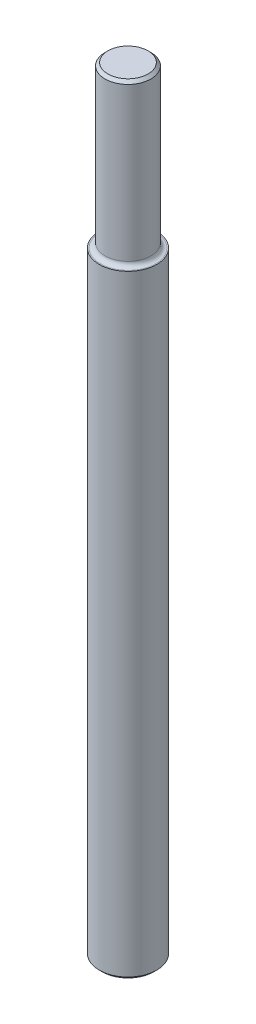
ISO-10303-21;
HEADER;
FILE_DESCRIPTION(('STEP AP214'),'2;1');
FILE_NAME('part.step','',(''),(''),'','','');
FILE_SCHEMA(('AUTOMOTIVE_DESIGN { 1 0 10303 214 1 1 1 1 }'));
ENDSEC;
DATA;
#1=APPLICATION_CONTEXT('core data for automotive mechanical design processes');
#2=APPLICATION_PROTOCOL_DEFINITION('international standard','automotive_design',2000,#1);
#3=PRODUCT_CONTEXT('',#1,'mechanical');
#4=PRODUCT('Part','Part','',(#3));
#5=PRODUCT_RELATED_PRODUCT_CATEGORY('part','',(#4));
#6=PRODUCT_DEFINITION_FORMATION('','',#4);
#7=PRODUCT_DEFINITION_CONTEXT('part definition',#1,'design');
#8=PRODUCT_DEFINITION('design','',#6,#7);
#9=PRODUCT_DEFINITION_SHAPE('','',#8);
#10=(LENGTH_UNIT() NAMED_UNIT(*) SI_UNIT(.MILLI.,.METRE.));
#11=(NAMED_UNIT(*) PLANE_ANGLE_UNIT() SI_UNIT($,.RADIAN.));
#12=(NAMED_UNIT(*) SI_UNIT($,.STERADIAN.) SOLID_ANGLE_UNIT());
#13=UNCERTAINTY_MEASURE_WITH_UNIT(LENGTH_MEASURE(1.E-05),#10,'distance_accuracy_value','');
#14=(GEOMETRIC_REPRESENTATION_CONTEXT(3) GLOBAL_UNCERTAINTY_ASSIGNED_CONTEXT((#13)) GLOBAL_UNIT_ASSIGNED_CONTEXT((#10,
#11,#12)) REPRESENTATION_CONTEXT('',''));
#15=CARTESIAN_POINT('',(0.,0.,0.));
#16=DIRECTION('',(0.,0.,1.));
#17=DIRECTION('',(1.,0.,0.));
#18=AXIS2_PLACEMENT_3D('',#15,#16,#17);
#19=CARTESIAN_POINT('',(0.,270.,0.));
#20=DIRECTION('',(0.,-1.,0.));
#21=DIRECTION('',(0.,0.,-1.));
#22=AXIS2_PLACEMENT_3D('',#19,#20,#21);
#23=CYLINDRICAL_SURFACE('',#22,10.);
#24=CARTESIAN_POINT('',(0.,1.,0.));
#25=DIRECTION('',(0.,1.,0.));
#26=DIRECTION('',(0.,0.,1.));
#27=AXIS2_PLACEMENT_3D('',#24,#25,#26);
#28=CIRCLE('',#27,10.);
#29=CARTESIAN_POINT('',(0.,1.,10.));
#30=VERTEX_POINT('',#29);
#31=EDGE_CURVE('E54',#30,#30,#28,.T.);
#32=ORIENTED_EDGE('',*,*,#31,.T.);
#33=EDGE_LOOP('',(#32));
#34=FACE_BOUND('',#33,.T.);
#35=CARTESIAN_POINT('',(0.,214.,0.));
#36=DIRECTION('',(0.,1.,0.));
#37=DIRECTION('',(0.,0.,1.));
#38=AXIS2_PLACEMENT_3D('',#35,#36,#37);
#39=CIRCLE('',#38,10.);
#40=CARTESIAN_POINT('',(0.,214.,10.));
#41=VERTEX_POINT('',#40);
#42=EDGE_CURVE('E67',#41,#41,#39,.T.);
#43=ORIENTED_EDGE('',*,*,#42,.F.);
#44=EDGE_LOOP('',(#43));
#45=FACE_BOUND('',#44,.T.);
#46=ADVANCED_FACE('F39',(#34,#45),#23,.T.);
#47=CARTESIAN_POINT('',(0.,0.,0.));
#48=DIRECTION('',(0.,1.,0.));
#49=DIRECTION('',(0.,0.,1.));
#50=AXIS2_PLACEMENT_3D('',#47,#48,#49);
#51=PLANE('',#50);
#52=CARTESIAN_POINT('',(0.,0.,0.));
#53=DIRECTION('',(0.,1.,0.));
#54=DIRECTION('',(0.,0.,1.));
#55=AXIS2_PLACEMENT_3D('',#52,#53,#54);
#56=CIRCLE('',#55,9.00000000000004);
#57=CARTESIAN_POINT('',(0.,0.,9.00000000000004));
#58=VERTEX_POINT('',#57);
#59=EDGE_CURVE('E50',#58,#58,#56,.F.);
#60=ORIENTED_EDGE('',*,*,#59,.T.);
#61=EDGE_LOOP('',(#60));
#62=FACE_BOUND('',#61,.T.);
#63=ADVANCED_FACE('F76',(#62),#51,.F.);
#64=CARTESIAN_POINT('',(0.,214.,0.));
#65=DIRECTION('',(0.,1.,0.));
#66=DIRECTION('',(0.,0.,1.));
#67=AXIS2_PLACEMENT_3D('',#64,#65,#66);
#68=PLANE('',#67);
#69=CARTESIAN_POINT('',(0.,214.,0.));
#70=DIRECTION('',(0.,1.,0.));
#71=DIRECTION('',(0.,0.,1.));
#72=AXIS2_PLACEMENT_3D('',#69,#70,#71);
#73=CIRCLE('',#72,9.6);
#74=CARTESIAN_POINT('',(0.,214.,9.6));
#75=VERTEX_POINT('',#74);
#76=EDGE_CURVE('E59',#75,#75,#73,.F.);
#77=ORIENTED_EDGE('',*,*,#76,.T.);
#78=EDGE_LOOP('',(#77));
#79=FACE_BOUND('',#78,.T.);
#80=ORIENTED_EDGE('',*,*,#42,.T.);
#81=EDGE_LOOP('',(#80));
#82=FACE_BOUND('',#81,.T.);
#83=ADVANCED_FACE('F73',(#79,#82),#68,.T.);
#84=CARTESIAN_POINT('',(0.,214.,0.));
#85=DIRECTION('',(0.,1.,0.));
#86=DIRECTION('',(0.,0.,1.));
#87=AXIS2_PLACEMENT_3D('',#84,#85,#86);
#88=CYLINDRICAL_SURFACE('',#87,8.);
#89=CARTESIAN_POINT('',(0.,269.,0.));
#90=DIRECTION('',(0.,1.,0.));
#91=DIRECTION('',(0.,0.,1.));
#92=AXIS2_PLACEMENT_3D('',#89,#90,#91);
#93=CIRCLE('',#92,8.);
#94=CARTESIAN_POINT('',(0.,269.,8.));
#95=VERTEX_POINT('',#94);
#96=EDGE_CURVE('E11',#95,#95,#93,.F.);
#97=ORIENTED_EDGE('',*,*,#96,.T.);
#98=EDGE_LOOP('',(#97));
#99=FACE_BOUND('',#98,.T.);
#100=CARTESIAN_POINT('',(0.,215.6,0.));
#101=DIRECTION('',(0.,1.,0.));
#102=DIRECTION('',(0.,0.,1.));
#103=AXIS2_PLACEMENT_3D('',#100,#101,#102);
#104=CIRCLE('',#103,8.);
#105=CARTESIAN_POINT('',(0.,215.6,8.));
#106=VERTEX_POINT('',#105);
#107=EDGE_CURVE('E63',#106,#106,#104,.T.);
#108=ORIENTED_EDGE('',*,*,#107,.T.);
#109=EDGE_LOOP('',(#108));
#110=FACE_BOUND('',#109,.T.);
#111=ADVANCED_FACE('F117',(#99,#110),#88,.T.);
#112=CARTESIAN_POINT('',(0.,270.,0.));
#113=DIRECTION('',(0.,1.,0.));
#114=DIRECTION('',(0.,0.,1.));
#115=AXIS2_PLACEMENT_3D('',#112,#113,#114);
#116=PLANE('',#115);
#117=CARTESIAN_POINT('',(0.,270.,0.));
#118=DIRECTION('',(0.,1.,0.));
#119=DIRECTION('',(0.,0.,1.));
#120=AXIS2_PLACEMENT_3D('',#117,#118,#119);
#121=CIRCLE('',#120,7.00000000000003);
#122=CARTESIAN_POINT('',(0.,270.,7.00000000000003));
#123=VERTEX_POINT('',#122);
#124=EDGE_CURVE('E46',#123,#123,#121,.T.);
#125=ORIENTED_EDGE('',*,*,#124,.T.);
#126=EDGE_LOOP('',(#125));
#127=FACE_BOUND('',#126,.T.);
#128=ADVANCED_FACE('F89',(#127),#116,.T.);
#129=CARTESIAN_POINT('',(0.,215.6,0.));
#130=DIRECTION('',(0.,1.,0.));
#131=DIRECTION('',(0.,0.,1.));
#132=AXIS2_PLACEMENT_3D('',#129,#130,#131);
#133=TOROIDAL_SURFACE('',#132,9.6,1.6);
#134=ORIENTED_EDGE('',*,*,#76,.F.);
#135=EDGE_LOOP('',(#134));
#136=FACE_BOUND('',#135,.T.);
#137=ORIENTED_EDGE('',*,*,#107,.F.);
#138=EDGE_LOOP('',(#137));
#139=FACE_BOUND('',#138,.T.);
#140=ADVANCED_FACE('F86',(#136,#139),#133,.F.);
#141=CARTESIAN_POINT('',(0.,1.,0.));
#142=DIRECTION('',(0.,1.,0.));
#143=DIRECTION('',(0.,0.,1.));
#144=AXIS2_PLACEMENT_3D('',#141,#142,#143);
#145=CONICAL_SURFACE('',#144,10.,0.78539816339743);
#146=ORIENTED_EDGE('',*,*,#59,.F.);
#147=EDGE_LOOP('',(#146));
#148=FACE_BOUND('',#147,.T.);
#149=ORIENTED_EDGE('',*,*,#31,.F.);
#150=EDGE_LOOP('',(#149));
#151=FACE_BOUND('',#150,.T.);
#152=ADVANCED_FACE('F88',(#148,#151),#145,.T.);
#153=CARTESIAN_POINT('',(0.,270.,0.));
#154=DIRECTION('',(0.,-1.,0.));
#155=DIRECTION('',(0.,0.,-1.));
#156=AXIS2_PLACEMENT_3D('',#153,#154,#155);
#157=CONICAL_SURFACE('',#156,7.00000000000003,0.785398163397459);
#158=ORIENTED_EDGE('',*,*,#96,.F.);
#159=EDGE_LOOP('',(#158));
#160=FACE_BOUND('',#159,.T.);
#161=ORIENTED_EDGE('',*,*,#124,.F.);
#162=EDGE_LOOP('',(#161));
#163=FACE_BOUND('',#162,.T.);
#164=ADVANCED_FACE('F41',(#160,#163),#157,.T.);
#165=CLOSED_SHELL('',(#46,#63,#83,#111,#128,#140,#152,#164));
#166=MANIFOLD_SOLID_BREP('B2',#165);
#167=ADVANCED_BREP_SHAPE_REPRESENTATION('',(#18,#166),#14);
#168=SHAPE_DEFINITION_REPRESENTATION(#9,#167);
ENDSEC;
END-ISO-10303-21;
